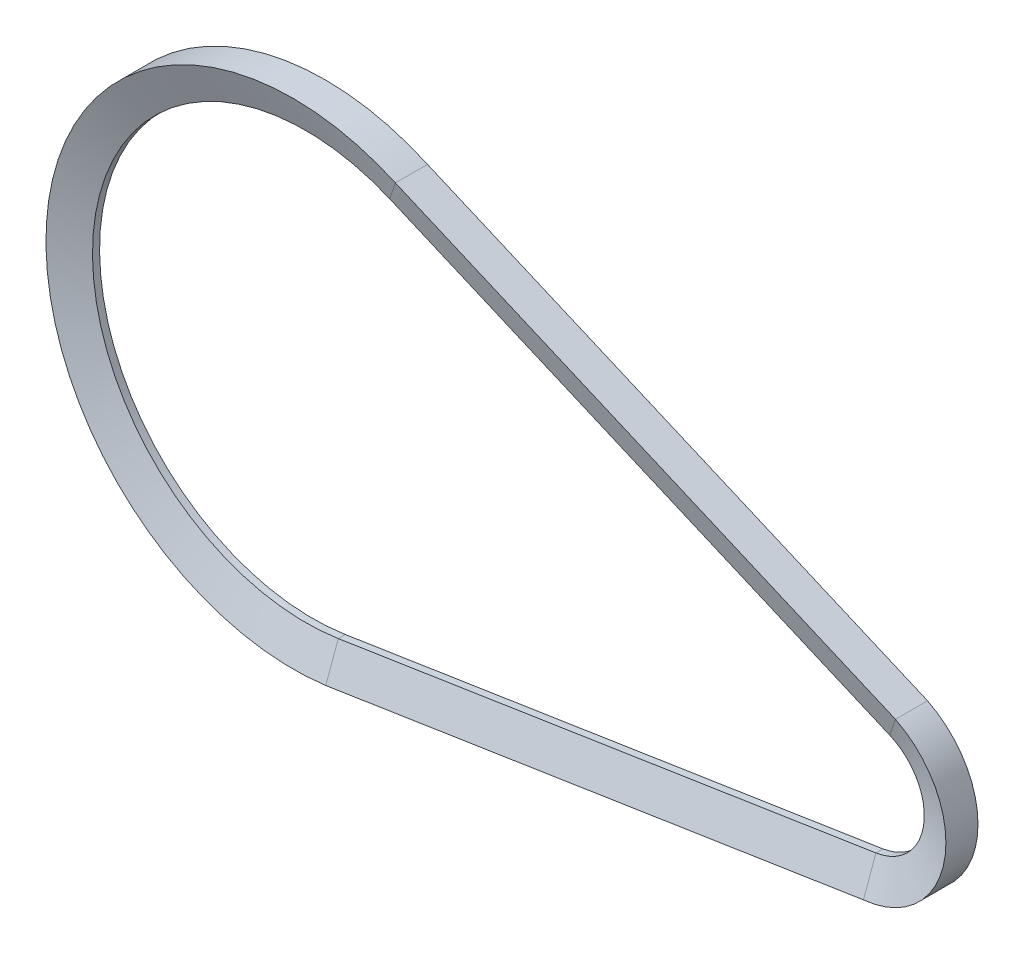
ISO-10303-21;
HEADER;
FILE_DESCRIPTION(('STEP AP214'),'2;1');
FILE_NAME('part.step','',(''),(''),'','','');
FILE_SCHEMA(('AUTOMOTIVE_DESIGN { 1 0 10303 214 1 1 1 1 }'));
ENDSEC;
DATA;
#1=APPLICATION_CONTEXT('core data for automotive mechanical design processes');
#2=APPLICATION_PROTOCOL_DEFINITION('international standard','automotive_design',2000,#1);
#3=PRODUCT_CONTEXT('',#1,'mechanical');
#4=PRODUCT('Part','Part','',(#3));
#5=PRODUCT_RELATED_PRODUCT_CATEGORY('part','',(#4));
#6=PRODUCT_DEFINITION_FORMATION('','',#4);
#7=PRODUCT_DEFINITION_CONTEXT('part definition',#1,'design');
#8=PRODUCT_DEFINITION('design','',#6,#7);
#9=PRODUCT_DEFINITION_SHAPE('','',#8);
#10=(LENGTH_UNIT() NAMED_UNIT(*) SI_UNIT(.MILLI.,.METRE.));
#11=(NAMED_UNIT(*) PLANE_ANGLE_UNIT() SI_UNIT($,.RADIAN.));
#12=(NAMED_UNIT(*) SI_UNIT($,.STERADIAN.) SOLID_ANGLE_UNIT());
#13=UNCERTAINTY_MEASURE_WITH_UNIT(LENGTH_MEASURE(1.E-05),#10,'distance_accuracy_value','');
#14=(GEOMETRIC_REPRESENTATION_CONTEXT(3) GLOBAL_UNCERTAINTY_ASSIGNED_CONTEXT((#13)) GLOBAL_UNIT_ASSIGNED_CONTEXT((#10,
#11,#12)) REPRESENTATION_CONTEXT('',''));
#15=CARTESIAN_POINT('',(0.,0.,0.));
#16=DIRECTION('',(0.,0.,1.));
#17=DIRECTION('',(1.,0.,0.));
#18=AXIS2_PLACEMENT_3D('',#15,#16,#17);
#19=CARTESIAN_POINT('',(0.,0.,0.));
#20=DIRECTION('',(0.,0.,1.));
#21=DIRECTION('',(1.,0.,0.));
#22=AXIS2_PLACEMENT_3D('',#19,#20,#21);
#23=CYLINDRICAL_SURFACE('',#22,46.5);
#24=CARTESIAN_POINT('',(0.,0.,-0.77022324300351));
#25=DIRECTION('',(0.,0.,1.));
#26=DIRECTION('',(0.394241676857398,0.919006800969757,0.));
#27=AXIS2_PLACEMENT_3D('',#24,#25,#26);
#28=CIRCLE('',#27,46.5);
#29=CARTESIAN_POINT('',(18.332237973869,42.7338162450937,-0.77022324300351));
#30=VERTEX_POINT('',#29);
#31=CARTESIAN_POINT('',(7.11062596211632,-45.9531173961776,-0.77022324300351));
#32=VERTEX_POINT('',#31);
#33=EDGE_CURVE('E11',#30,#32,#28,.T.);
#34=ORIENTED_EDGE('',*,*,#33,.F.);
#35=DIRECTION('',(0.,0.,1.));
#36=VECTOR('',#35,1.);
#37=CARTESIAN_POINT('',(18.332237973869,42.7338162450937,0.77022324300351));
#38=LINE('',#37,#36);
#39=CARTESIAN_POINT('',(18.332237973869,42.7338162450937,0.77022324300351));
#40=VERTEX_POINT('',#39);
#41=EDGE_CURVE('E42',#30,#40,#38,.T.);
#42=ORIENTED_EDGE('',*,*,#41,.T.);
#43=CARTESIAN_POINT('',(0.,0.,0.77022324300351));
#44=DIRECTION('',(0.,0.,1.));
#45=DIRECTION('',(0.394241676857398,0.919006800969757,0.));
#46=AXIS2_PLACEMENT_3D('',#43,#44,#45);
#47=CIRCLE('',#46,46.5);
#48=CARTESIAN_POINT('',(7.11062596211632,-45.9531173961776,0.77022324300351));
#49=VERTEX_POINT('',#48);
#50=EDGE_CURVE('E124',#40,#49,#47,.T.);
#51=ORIENTED_EDGE('',*,*,#50,.T.);
#52=DIRECTION('',(0.,0.,1.));
#53=VECTOR('',#52,1.);
#54=CARTESIAN_POINT('',(7.11062596211632,-45.9531173961776,0.77022324300351));
#55=LINE('',#54,#53);
#56=EDGE_CURVE('E127',#32,#49,#55,.T.);
#57=ORIENTED_EDGE('',*,*,#56,.F.);
#58=EDGE_LOOP('',(#34,#42,#51,#57));
#59=FACE_BOUND('',#58,.T.);
#60=ADVANCED_FACE('F39',(#59),#23,.F.);
#61=CARTESIAN_POINT('',(22.3082617928095,49.0931585531644,-3.5));
#62=CARTESIAN_POINT('',(-13.2796104913501,65.2645273336913,-3.5));
#63=CARTESIAN_POINT('',(-47.6107589327741,46.5727626058127,-3.5));
#64=CARTESIAN_POINT('',(-53.3413762191592,7.9053364247693,-3.5));
#65=CARTESIAN_POINT('',(-59.0719935055442,-30.7620897562741,-3.5));
#66=CARTESIAN_POINT('',(-31.6378019481661,-58.6076451564191,-3.5));
#67=CARTESIAN_POINT('',(7.11062596211633,-53.4531173961776,-3.5));
#68=CARTESIAN_POINT('',(18.332237973869,42.7338162450937,-0.770223243003509));
#69=CARTESIAN_POINT('',(-12.6457157688753,56.0229457882736,-0.770223243003509));
#70=CARTESIAN_POINT('',(-41.9008120890564,39.2785759464445,-0.770223243003509));
#71=CARTESIAN_POINT('',(-46.1321783681313,5.83713277311048,-0.770223243003509));
#72=CARTESIAN_POINT('',(-50.3635446472062,-27.6043104002236,-0.770223243003509));
#73=CARTESIAN_POINT('',(-26.201015031265,-51.1076451564191,-0.770223243003509));
#74=CARTESIAN_POINT('',(7.11062596211633,-45.9531173961776,-0.770223243003509));
#75=(BOUNDED_SURFACE() B_SPLINE_SURFACE(1,3,((#61,#62,#63,#64,#65,#66,#67),(#68,#69,#70,#71,#72,
#73,#74)),.UNSPECIFIED.,.F.,.F.,.F.) B_SPLINE_SURFACE_WITH_KNOTS((2,2),(4,3,4),(0.,1.),(0.,0.5,
1.),.UNSPECIFIED.) GEOMETRIC_REPRESENTATION_ITEM() RATIONAL_B_SPLINE_SURFACE(((1.,
0.734509247397131,0.734509247397131,1.,0.734509247397131,0.734509247397131,1.),(1.,
0.734509247397131,0.734509247397131,1.,0.734509247397131,0.734509247397131,1.))) REPRESENTATION_ITEM('') SURFACE());
#76=CARTESIAN_POINT('',(0.,0.,-3.5));
#77=DIRECTION('',(0.,0.,1.));
#78=DIRECTION('',(0.413698273245811,0.910414047954794,0.));
#79=AXIS2_PLACEMENT_3D('',#76,#77,#78);
#80=CIRCLE('',#79,53.9239905880737);
#81=CARTESIAN_POINT('',(22.3082617928095,49.0931585531644,-3.5));
#82=VERTEX_POINT('',#81);
#83=CARTESIAN_POINT('',(7.11062596211632,-53.4531173961776,-3.5));
#84=VERTEX_POINT('',#83);
#85=EDGE_CURVE('E47',#82,#84,#80,.T.);
#86=DIRECTION('',(-0.498165365696983,-0.796776938659423,0.342020143325666));
#87=VECTOR('',#86,1.);
#88=CARTESIAN_POINT('',(22.3082617928095,49.0931585531644,-3.5));
#89=LINE('',#88,#87);
#90=EDGE_CURVE('E193',#82,#30,#89,.T.);
#91=DIRECTION('',(0.,0.939692620785909,0.342020143325666));
#92=VECTOR('',#91,1.);
#93=CARTESIAN_POINT('',(7.11062596211632,-53.4531173961776,-3.5));
#94=LINE('',#93,#92);
#95=EDGE_CURVE('E152',#84,#32,#94,.T.);
#96=ORIENTED_EDGE('',*,*,#85,.F.);
#97=ORIENTED_EDGE('',*,*,#90,.T.);
#98=ORIENTED_EDGE('',*,*,#33,.T.);
#99=ORIENTED_EDGE('',*,*,#95,.F.);
#100=EDGE_LOOP('',(#96,#97,#98,#99));
#101=FACE_BOUND('',#100,.T.);
#102=ADVANCED_FACE('F233',(#101),#75,.T.);
#103=CARTESIAN_POINT('',(0.,0.,0.));
#104=DIRECTION('',(0.,0.,1.));
#105=DIRECTION('',(1.,0.,0.));
#106=AXIS2_PLACEMENT_3D('',#103,#104,#105);
#107=CYLINDRICAL_SURFACE('',#106,53.9239905880737);
#108=CARTESIAN_POINT('',(0.,0.,3.5));
#109=DIRECTION('',(0.,0.,1.));
#110=DIRECTION('',(0.413698273245811,0.910414047954794,0.));
#111=AXIS2_PLACEMENT_3D('',#108,#109,#110);
#112=CIRCLE('',#111,53.9239905880737);
#113=CARTESIAN_POINT('',(22.3082617928095,49.0931585531644,3.5));
#114=VERTEX_POINT('',#113);
#115=CARTESIAN_POINT('',(7.11062596211632,-53.4531173961776,3.5));
#116=VERTEX_POINT('',#115);
#117=EDGE_CURVE('E133',#114,#116,#112,.T.);
#118=ORIENTED_EDGE('',*,*,#117,.F.);
#119=DIRECTION('',(0.,0.,-1.));
#120=VECTOR('',#119,1.);
#121=CARTESIAN_POINT('',(22.3082617928095,49.0931585531644,3.5));
#122=LINE('',#121,#120);
#123=EDGE_CURVE('E177',#114,#82,#122,.T.);
#124=ORIENTED_EDGE('',*,*,#123,.T.);
#125=ORIENTED_EDGE('',*,*,#85,.T.);
#126=DIRECTION('',(0.,0.,-1.));
#127=VECTOR('',#126,1.);
#128=CARTESIAN_POINT('',(7.11062596211632,-53.4531173961776,3.5));
#129=LINE('',#128,#127);
#130=EDGE_CURVE('E157',#116,#84,#129,.T.);
#131=ORIENTED_EDGE('',*,*,#130,.F.);
#132=EDGE_LOOP('',(#118,#124,#125,#131));
#133=FACE_BOUND('',#132,.T.);
#134=ADVANCED_FACE('F229',(#133),#107,.T.);
#135=CARTESIAN_POINT('',(127.408308876875,-4.05836532792656,0.77022324300351));
#136=DIRECTION('',(-0.394241676857398,-0.919006800969757,0.));
#137=DIRECTION('',(0.919006800969757,-0.394241676857398,0.));
#138=AXIS2_PLACEMENT_3D('',#135,#136,#137);
#139=PLANE('',#138);
#140=ORIENTED_EDGE('',*,*,#41,.F.);
#141=DIRECTION('',(-0.919006800969757,0.394241676857398,0.));
#142=VECTOR('',#141,1.);
#143=CARTESIAN_POINT('',(127.408308876875,-4.05836532792656,-0.77022324300351));
#144=LINE('',#143,#142);
#145=CARTESIAN_POINT('',(127.408308876875,-4.05836532792655,-0.77022324300351));
#146=VERTEX_POINT('',#145);
#147=EDGE_CURVE('E55',#146,#30,#144,.T.);
#148=ORIENTED_EDGE('',*,*,#147,.F.);
#149=DIRECTION('',(0.,0.,1.));
#150=VECTOR('',#149,1.);
#151=CARTESIAN_POINT('',(127.408308876875,-4.05836532792656,0.77022324300351));
#152=LINE('',#151,#150);
#153=CARTESIAN_POINT('',(127.408308876875,-4.05836532792655,0.77022324300351));
#154=VERTEX_POINT('',#153);
#155=EDGE_CURVE('E181',#146,#154,#152,.T.);
#156=ORIENTED_EDGE('',*,*,#155,.T.);
#157=DIRECTION('',(-0.919006800969757,0.394241676857398,0.));
#158=VECTOR('',#157,1.);
#159=CARTESIAN_POINT('',(127.408308876875,-4.05836532792656,0.77022324300351));
#160=LINE('',#159,#158);
#161=EDGE_CURVE('E179',#154,#40,#160,.T.);
#162=ORIENTED_EDGE('',*,*,#161,.T.);
#163=EDGE_LOOP('',(#140,#148,#156,#162));
#164=FACE_BOUND('',#163,.T.);
#165=ADVANCED_FACE('F208',(#164),#139,.T.);
#166=CARTESIAN_POINT('',(131.384332695815,2.30097698014414,-3.5));
#167=DIRECTION('',(-0.136252615151092,-0.317615024803837,-0.938379412009527));
#168=DIRECTION('',(0.,0.947213000656084,-0.320604945981962));
#169=AXIS2_PLACEMENT_3D('',#166,#167,#168);
#170=PLANE('',#169);
#171=ORIENTED_EDGE('',*,*,#147,.T.);
#172=ORIENTED_EDGE('',*,*,#90,.F.);
#173=DIRECTION('',(-0.919006800969757,0.394241676857398,0.));
#174=VECTOR('',#173,1.);
#175=CARTESIAN_POINT('',(131.384332695815,2.30097698014414,-3.5));
#176=LINE('',#175,#174);
#177=CARTESIAN_POINT('',(131.384332695815,2.30097698014415,-3.5));
#178=VERTEX_POINT('',#177);
#179=EDGE_CURVE('E64',#178,#82,#176,.T.);
#180=ORIENTED_EDGE('',*,*,#179,.F.);
#181=DIRECTION('',(-0.498165365696984,-0.796776938659423,0.342020143325666));
#182=VECTOR('',#181,1.);
#183=CARTESIAN_POINT('',(131.384332695815,2.30097698014415,-3.5));
#184=LINE('',#183,#182);
#185=EDGE_CURVE('E190',#178,#146,#184,.T.);
#186=ORIENTED_EDGE('',*,*,#185,.T.);
#187=EDGE_LOOP('',(#171,#172,#180,#186));
#188=FACE_BOUND('',#187,.T.);
#189=ADVANCED_FACE('F219',(#188),#170,.T.);
#190=CARTESIAN_POINT('',(131.384332695815,2.30097698014414,3.5));
#191=DIRECTION('',(0.394241676857398,0.919006800969757,0.));
#192=DIRECTION('',(-0.919006800969757,0.394241676857398,0.));
#193=AXIS2_PLACEMENT_3D('',#190,#191,#192);
#194=PLANE('',#193);
#195=ORIENTED_EDGE('',*,*,#179,.T.);
#196=ORIENTED_EDGE('',*,*,#123,.F.);
#197=DIRECTION('',(-0.919006800969757,0.394241676857398,0.));
#198=VECTOR('',#197,1.);
#199=CARTESIAN_POINT('',(131.384332695815,2.30097698014414,3.5));
#200=LINE('',#199,#198);
#201=CARTESIAN_POINT('',(131.384332695815,2.30097698014415,3.5));
#202=VERTEX_POINT('',#201);
#203=EDGE_CURVE('E92',#202,#114,#200,.T.);
#204=ORIENTED_EDGE('',*,*,#203,.F.);
#205=DIRECTION('',(0.,0.,-1.));
#206=VECTOR('',#205,1.);
#207=CARTESIAN_POINT('',(131.384332695815,2.30097698014415,3.5));
#208=LINE('',#207,#206);
#209=EDGE_CURVE('E171',#202,#178,#208,.T.);
#210=ORIENTED_EDGE('',*,*,#209,.T.);
#211=EDGE_LOOP('',(#195,#196,#204,#210));
#212=FACE_BOUND('',#211,.T.);
#213=ADVANCED_FACE('F221',(#212),#194,.T.);
#214=CARTESIAN_POINT('',(127.408308876875,-4.05836532792656,0.77022324300351));
#215=DIRECTION('',(-0.136252615151092,-0.317615024803837,0.938379412009527));
#216=DIRECTION('',(0.,-0.947213000656084,-0.320604945981962));
#217=AXIS2_PLACEMENT_3D('',#214,#215,#216);
#218=PLANE('',#217);
#219=ORIENTED_EDGE('',*,*,#203,.T.);
#220=DIRECTION('',(0.498165365696983,0.796776938659423,0.342020143325666));
#221=VECTOR('',#220,1.);
#222=CARTESIAN_POINT('',(18.332237973869,42.7338162450937,0.77022324300351));
#223=LINE('',#222,#221);
#224=EDGE_CURVE('E175',#40,#114,#223,.T.);
#225=ORIENTED_EDGE('',*,*,#224,.F.);
#226=ORIENTED_EDGE('',*,*,#161,.F.);
#227=DIRECTION('',(0.498165365696984,0.796776938659423,0.342020143325666));
#228=VECTOR('',#227,1.);
#229=CARTESIAN_POINT('',(127.408308876875,-4.05836532792656,0.77022324300351));
#230=LINE('',#229,#228);
#231=EDGE_CURVE('E166',#154,#202,#230,.T.);
#232=ORIENTED_EDGE('',*,*,#231,.T.);
#233=EDGE_LOOP('',(#219,#225,#226,#232));
#234=FACE_BOUND('',#233,.T.);
#235=ADVANCED_FACE('F227',(#234),#218,.T.);
#236=CARTESIAN_POINT('',(122.5,-15.5,0.));
#237=DIRECTION('',(0.,0.,1.));
#238=DIRECTION('',(1.,0.,0.));
#239=AXIS2_PLACEMENT_3D('',#236,#237,#238);
#240=CYLINDRICAL_SURFACE('',#239,12.45);
#241=ORIENTED_EDGE('',*,*,#155,.F.);
#242=CARTESIAN_POINT('',(122.5,-15.5,-0.77022324300351));
#243=DIRECTION('',(0.,0.,1.));
#244=DIRECTION('',(0.152916687357341,-0.988239083788765,0.));
#245=AXIS2_PLACEMENT_3D('',#242,#243,#244);
#246=CIRCLE('',#245,12.45);
#247=CARTESIAN_POINT('',(124.403812757599,-27.8035765931701,-0.77022324300351));
#248=VERTEX_POINT('',#247);
#249=EDGE_CURVE('E200',#248,#146,#246,.T.);
#250=ORIENTED_EDGE('',*,*,#249,.F.);
#251=DIRECTION('',(0.,0.,1.));
#252=VECTOR('',#251,1.);
#253=CARTESIAN_POINT('',(124.403812757599,-27.8035765931701,0.77022324300351));
#254=LINE('',#253,#252);
#255=CARTESIAN_POINT('',(124.403812757599,-27.8035765931701,0.77022324300351));
#256=VERTEX_POINT('',#255);
#257=EDGE_CURVE('E174',#248,#256,#254,.T.);
#258=ORIENTED_EDGE('',*,*,#257,.T.);
#259=CARTESIAN_POINT('',(122.5,-15.5,0.77022324300351));
#260=DIRECTION('',(0.,0.,1.));
#261=DIRECTION('',(0.152916687357341,-0.988239083788765,0.));
#262=AXIS2_PLACEMENT_3D('',#259,#260,#261);
#263=CIRCLE('',#262,12.45);
#264=EDGE_CURVE('E169',#256,#154,#263,.T.);
#265=ORIENTED_EDGE('',*,*,#264,.T.);
#266=EDGE_LOOP('',(#241,#250,#258,#265));
#267=FACE_BOUND('',#266,.T.);
#268=ADVANCED_FACE('F213',(#267),#240,.F.);
#269=CARTESIAN_POINT('',(124.403812757599,-35.3035765931701,-3.5));
#270=CARTESIAN_POINT('',(148.941953800057,-32.9446074572361,-3.5));
#271=CARTESIAN_POINT('',(153.441100157859,-8.70738849022327,-3.5));
#272=CARTESIAN_POINT('',(131.384332695815,2.30097698014416,-3.5));
#273=CARTESIAN_POINT('',(124.403812757599,-27.8035765931701,-0.770223243003509));
#274=CARTESIAN_POINT('',(139.648882068665,-25.4446074572361,-0.770223243003509));
#275=CARTESIAN_POINT('',(141.585366441135,-10.1401341909427,-0.770223243003509));
#276=CARTESIAN_POINT('',(127.408308876875,-4.05836532792654,-0.770223243003509));
#277=(BOUNDED_SURFACE() B_SPLINE_SURFACE(1,3,((#269,#270,#271,#272),(#273,#274,#275,#276)),
.UNSPECIFIED.,.F.,.F.,.F.) B_SPLINE_SURFACE_WITH_KNOTS((2,2),(4,4),(0.,1.),(0.,1.),
.UNSPECIFIED.) GEOMETRIC_REPRESENTATION_ITEM() RATIONAL_B_SPLINE_SURFACE(((1.,0.517173657925228,
0.517173657925228,1.),(1.,0.517173657925228,0.517173657925228,1.))) REPRESENTATION_ITEM('') SURFACE());
#278=CARTESIAN_POINT('',(122.5,-15.5,-3.5));
#279=DIRECTION('',(0.,0.,1.));
#280=DIRECTION('',(0.0956936157073579,-0.995410835742133,0.));
#281=AXIS2_PLACEMENT_3D('',#278,#279,#280);
#282=CIRCLE('',#281,19.8948774536952);
#283=CARTESIAN_POINT('',(124.403812757599,-35.3035765931701,-3.5));
#284=VERTEX_POINT('',#283);
#285=EDGE_CURVE('E105',#284,#178,#282,.T.);
#286=DIRECTION('',(0.,0.939692620785909,0.342020143325666));
#287=VECTOR('',#286,1.);
#288=CARTESIAN_POINT('',(124.403812757599,-35.3035765931701,-3.5));
#289=LINE('',#288,#287);
#290=EDGE_CURVE('E187',#284,#248,#289,.T.);
#291=ORIENTED_EDGE('',*,*,#249,.T.);
#292=ORIENTED_EDGE('',*,*,#185,.F.);
#293=ORIENTED_EDGE('',*,*,#285,.F.);
#294=ORIENTED_EDGE('',*,*,#290,.T.);
#295=EDGE_LOOP('',(#291,#292,#293,#294));
#296=FACE_BOUND('',#295,.T.);
#297=ADVANCED_FACE('F218',(#296),#277,.T.);
#298=CARTESIAN_POINT('',(122.5,-15.5,0.));
#299=DIRECTION('',(0.,0.,1.));
#300=DIRECTION('',(1.,0.,0.));
#301=AXIS2_PLACEMENT_3D('',#298,#299,#300);
#302=CYLINDRICAL_SURFACE('',#301,19.8948774536952);
#303=ORIENTED_EDGE('',*,*,#285,.T.);
#304=ORIENTED_EDGE('',*,*,#209,.F.);
#305=CARTESIAN_POINT('',(122.5,-15.5,3.5));
#306=DIRECTION('',(0.,0.,1.));
#307=DIRECTION('',(0.0956936157073579,-0.995410835742133,0.));
#308=AXIS2_PLACEMENT_3D('',#305,#306,#307);
#309=CIRCLE('',#308,19.8948774536952);
#310=CARTESIAN_POINT('',(124.403812757599,-35.3035765931701,3.5));
#311=VERTEX_POINT('',#310);
#312=EDGE_CURVE('E111',#311,#202,#309,.T.);
#313=ORIENTED_EDGE('',*,*,#312,.F.);
#314=DIRECTION('',(0.,0.,-1.));
#315=VECTOR('',#314,1.);
#316=CARTESIAN_POINT('',(124.403812757599,-35.3035765931701,3.5));
#317=LINE('',#316,#315);
#318=EDGE_CURVE('E164',#311,#284,#317,.T.);
#319=ORIENTED_EDGE('',*,*,#318,.T.);
#320=EDGE_LOOP('',(#303,#304,#313,#319));
#321=FACE_BOUND('',#320,.T.);
#322=ADVANCED_FACE('F258',(#321),#302,.T.);
#323=CARTESIAN_POINT('',(124.403812757599,-27.8035765931701,0.77022324300351));
#324=CARTESIAN_POINT('',(139.648882068665,-25.4446074572361,0.77022324300351));
#325=CARTESIAN_POINT('',(141.585366441135,-10.1401341909427,0.77022324300351));
#326=CARTESIAN_POINT('',(127.408308876875,-4.05836532792654,0.77022324300351));
#327=CARTESIAN_POINT('',(124.403812757599,-35.3035765931701,3.5));
#328=CARTESIAN_POINT('',(148.941953800057,-32.9446074572361,3.5));
#329=CARTESIAN_POINT('',(153.441100157859,-8.70738849022327,3.5));
#330=CARTESIAN_POINT('',(131.384332695815,2.30097698014416,3.5));
#331=(BOUNDED_SURFACE() B_SPLINE_SURFACE(1,3,((#323,#324,#325,#326),(#327,#328,#329,#330)),
.UNSPECIFIED.,.F.,.F.,.F.) B_SPLINE_SURFACE_WITH_KNOTS((2,2),(4,4),(0.,1.),(0.,1.),
.UNSPECIFIED.) GEOMETRIC_REPRESENTATION_ITEM() RATIONAL_B_SPLINE_SURFACE(((1.,0.517173657925228,
0.517173657925228,1.),(1.,0.517173657925228,0.517173657925228,1.))) REPRESENTATION_ITEM('') SURFACE());
#332=DIRECTION('',(0.,-0.939692620785909,0.342020143325666));
#333=VECTOR('',#332,1.);
#334=CARTESIAN_POINT('',(124.403812757599,-27.8035765931701,0.77022324300351));
#335=LINE('',#334,#333);
#336=EDGE_CURVE('E144',#256,#311,#335,.T.);
#337=ORIENTED_EDGE('',*,*,#312,.T.);
#338=ORIENTED_EDGE('',*,*,#231,.F.);
#339=ORIENTED_EDGE('',*,*,#264,.F.);
#340=ORIENTED_EDGE('',*,*,#336,.T.);
#341=EDGE_LOOP('',(#337,#338,#339,#340));
#342=FACE_BOUND('',#341,.T.);
#343=ADVANCED_FACE('F211',(#342),#331,.T.);
#344=CARTESIAN_POINT('',(7.11062596211632,-45.9531173961776,0.77022324300351));
#345=DIRECTION('',(-0.15291668735734,0.988239083788765,0.));
#346=DIRECTION('',(-0.988239083788765,-0.15291668735734,0.));
#347=AXIS2_PLACEMENT_3D('',#344,#345,#346);
#348=PLANE('',#347);
#349=ORIENTED_EDGE('',*,*,#257,.F.);
#350=DIRECTION('',(0.988239083788765,0.15291668735734,0.));
#351=VECTOR('',#350,1.);
#352=CARTESIAN_POINT('',(7.11062596211632,-45.9531173961776,-0.77022324300351));
#353=LINE('',#352,#351);
#354=EDGE_CURVE('E151',#32,#248,#353,.T.);
#355=ORIENTED_EDGE('',*,*,#354,.F.);
#356=ORIENTED_EDGE('',*,*,#56,.T.);
#357=DIRECTION('',(0.988239083788765,0.15291668735734,0.));
#358=VECTOR('',#357,1.);
#359=CARTESIAN_POINT('',(7.11062596211632,-45.9531173961776,0.77022324300351));
#360=LINE('',#359,#358);
#361=EDGE_CURVE('E139',#49,#256,#360,.T.);
#362=ORIENTED_EDGE('',*,*,#361,.T.);
#363=EDGE_LOOP('',(#349,#355,#356,#362));
#364=FACE_BOUND('',#363,.T.);
#365=ADVANCED_FACE('F149',(#364),#348,.T.);
#366=CARTESIAN_POINT('',(7.11062596211632,-53.4531173961776,-3.5));
#367=DIRECTION('',(-0.0528490511677079,0.341542174419686,-0.938379412009527));
#368=DIRECTION('',(0.,0.939692620785909,0.342020143325666));
#369=AXIS2_PLACEMENT_3D('',#366,#367,#368);
#370=PLANE('',#369);
#371=ORIENTED_EDGE('',*,*,#354,.T.);
#372=ORIENTED_EDGE('',*,*,#290,.F.);
#373=DIRECTION('',(0.988239083788765,0.15291668735734,0.));
#374=VECTOR('',#373,1.);
#375=CARTESIAN_POINT('',(7.11062596211632,-53.4531173961776,-3.5));
#376=LINE('',#375,#374);
#377=EDGE_CURVE('E184',#84,#284,#376,.T.);
#378=ORIENTED_EDGE('',*,*,#377,.F.);
#379=ORIENTED_EDGE('',*,*,#95,.T.);
#380=EDGE_LOOP('',(#371,#372,#378,#379));
#381=FACE_BOUND('',#380,.T.);
#382=ADVANCED_FACE('F215',(#381),#370,.T.);
#383=CARTESIAN_POINT('',(7.11062596211632,-53.4531173961776,3.5));
#384=DIRECTION('',(0.15291668735734,-0.988239083788765,0.));
#385=DIRECTION('',(0.988239083788765,0.15291668735734,0.));
#386=AXIS2_PLACEMENT_3D('',#383,#384,#385);
#387=PLANE('',#386);
#388=ORIENTED_EDGE('',*,*,#377,.T.);
#389=ORIENTED_EDGE('',*,*,#318,.F.);
#390=DIRECTION('',(0.988239083788765,0.15291668735734,0.));
#391=VECTOR('',#390,1.);
#392=CARTESIAN_POINT('',(7.11062596211632,-53.4531173961776,3.5));
#393=LINE('',#392,#391);
#394=EDGE_CURVE('E163',#116,#311,#393,.T.);
#395=ORIENTED_EDGE('',*,*,#394,.F.);
#396=ORIENTED_EDGE('',*,*,#130,.T.);
#397=EDGE_LOOP('',(#388,#389,#395,#396));
#398=FACE_BOUND('',#397,.T.);
#399=ADVANCED_FACE('F271',(#398),#387,.T.);
#400=CARTESIAN_POINT('',(7.11062596211632,-45.9531173961776,0.77022324300351));
#401=DIRECTION('',(-0.0528490511677079,0.341542174419685,0.938379412009527));
#402=DIRECTION('',(0.,-0.939692620785909,0.342020143325666));
#403=AXIS2_PLACEMENT_3D('',#400,#401,#402);
#404=PLANE('',#403);
#405=ORIENTED_EDGE('',*,*,#394,.T.);
#406=ORIENTED_EDGE('',*,*,#336,.F.);
#407=ORIENTED_EDGE('',*,*,#361,.F.);
#408=DIRECTION('',(0.,-0.939692620785909,0.342020143325666));
#409=VECTOR('',#408,1.);
#410=CARTESIAN_POINT('',(7.11062596211632,-45.9531173961776,0.77022324300351));
#411=LINE('',#410,#409);
#412=EDGE_CURVE('E142',#49,#116,#411,.T.);
#413=ORIENTED_EDGE('',*,*,#412,.T.);
#414=EDGE_LOOP('',(#405,#406,#407,#413));
#415=FACE_BOUND('',#414,.T.);
#416=ADVANCED_FACE('F141',(#415),#404,.T.);
#417=CARTESIAN_POINT('',(18.332237973869,42.7338162450937,0.77022324300351));
#418=CARTESIAN_POINT('',(-12.6457157688753,56.0229457882736,0.77022324300351));
#419=CARTESIAN_POINT('',(-41.9008120890564,39.2785759464445,0.77022324300351));
#420=CARTESIAN_POINT('',(-46.1321783681313,5.83713277311048,0.77022324300351));
#421=CARTESIAN_POINT('',(-50.3635446472062,-27.6043104002236,0.77022324300351));
#422=CARTESIAN_POINT('',(-26.201015031265,-51.1076451564191,0.77022324300351));
#423=CARTESIAN_POINT('',(7.11062596211633,-45.9531173961776,0.77022324300351));
#424=CARTESIAN_POINT('',(22.3082617928095,49.0931585531644,3.5));
#425=CARTESIAN_POINT('',(-13.2796104913501,65.2645273336913,3.5));
#426=CARTESIAN_POINT('',(-47.6107589327741,46.5727626058127,3.5));
#427=CARTESIAN_POINT('',(-53.3413762191592,7.9053364247693,3.5));
#428=CARTESIAN_POINT('',(-59.0719935055442,-30.7620897562741,3.5));
#429=CARTESIAN_POINT('',(-31.6378019481661,-58.6076451564191,3.5));
#430=CARTESIAN_POINT('',(7.11062596211633,-53.4531173961776,3.5));
#431=(BOUNDED_SURFACE() B_SPLINE_SURFACE(1,3,((#417,#418,#419,#420,#421,#422,#423),(#424,#425,
#426,#427,#428,#429,#430)),.UNSPECIFIED.,.F.,.F.,.F.) B_SPLINE_SURFACE_WITH_KNOTS((2,2),(4,3,4),
(0.,1.),(0.,0.5,1.),
.UNSPECIFIED.) GEOMETRIC_REPRESENTATION_ITEM() RATIONAL_B_SPLINE_SURFACE(((1.,0.734509247397131,
0.734509247397131,1.,0.734509247397131,0.734509247397131,1.),(1.,0.734509247397131,
0.734509247397131,1.,0.734509247397131,0.734509247397131,1.))) REPRESENTATION_ITEM('') SURFACE());
#432=ORIENTED_EDGE('',*,*,#224,.T.);
#433=ORIENTED_EDGE('',*,*,#117,.T.);
#434=ORIENTED_EDGE('',*,*,#412,.F.);
#435=ORIENTED_EDGE('',*,*,#50,.F.);
#436=EDGE_LOOP('',(#432,#433,#434,#435));
#437=FACE_BOUND('',#436,.T.);
#438=ADVANCED_FACE('F154',(#437),#431,.T.);
#439=CLOSED_SHELL('',(#60,#102,#134,#165,#189,#213,#235,#268,#297,#322,#343,#365,#382,#399,#416,#438));
#440=MANIFOLD_SOLID_BREP('B2',#439);
#441=ADVANCED_BREP_SHAPE_REPRESENTATION('',(#18,#440),#14);
#442=SHAPE_DEFINITION_REPRESENTATION(#9,#441);
ENDSEC;
END-ISO-10303-21;
